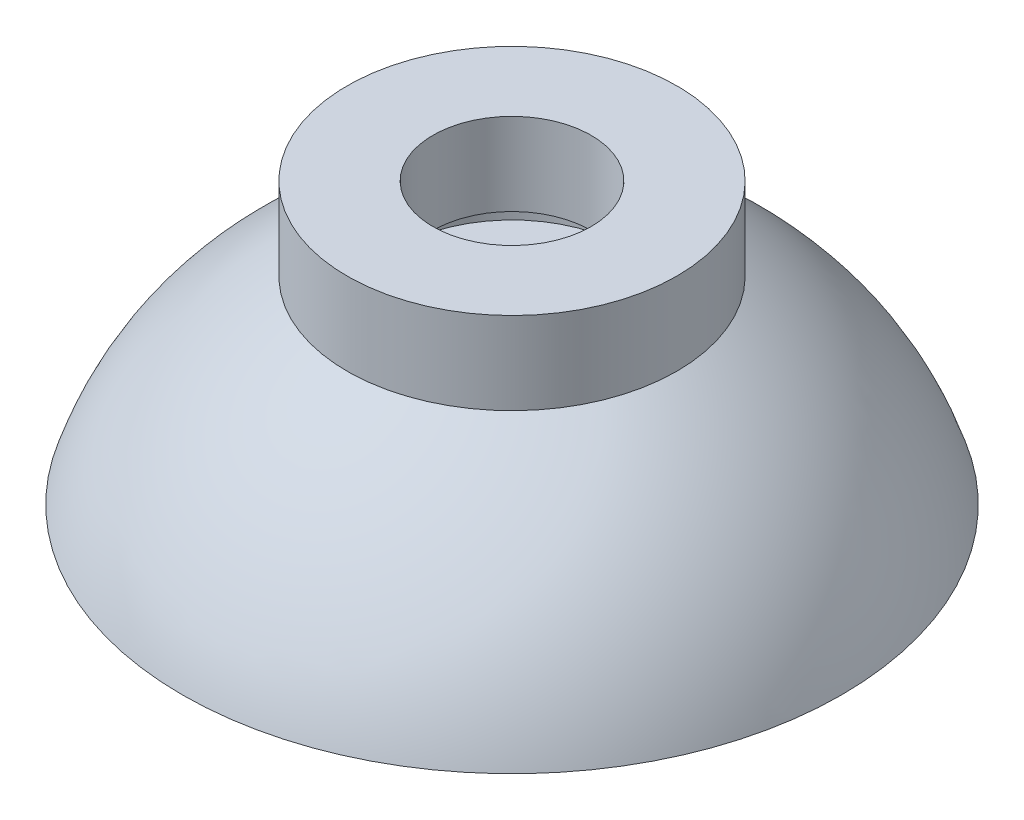
ISO-10303-21;
HEADER;
FILE_DESCRIPTION(('STEP AP214'),'2;1');
FILE_NAME('part.step','',(''),(''),'','','');
FILE_SCHEMA(('AUTOMOTIVE_DESIGN { 1 0 10303 214 1 1 1 1 }'));
ENDSEC;
DATA;
#1=APPLICATION_CONTEXT('core data for automotive mechanical design processes');
#2=APPLICATION_PROTOCOL_DEFINITION('international standard','automotive_design',2000,#1);
#3=PRODUCT_CONTEXT('',#1,'mechanical');
#4=PRODUCT('Part','Part','',(#3));
#5=PRODUCT_RELATED_PRODUCT_CATEGORY('part','',(#4));
#6=PRODUCT_DEFINITION_FORMATION('','',#4);
#7=PRODUCT_DEFINITION_CONTEXT('part definition',#1,'design');
#8=PRODUCT_DEFINITION('design','',#6,#7);
#9=PRODUCT_DEFINITION_SHAPE('','',#8);
#10=(LENGTH_UNIT() NAMED_UNIT(*) SI_UNIT(.MILLI.,.METRE.));
#11=(NAMED_UNIT(*) PLANE_ANGLE_UNIT() SI_UNIT($,.RADIAN.));
#12=(NAMED_UNIT(*) SI_UNIT($,.STERADIAN.) SOLID_ANGLE_UNIT());
#13=UNCERTAINTY_MEASURE_WITH_UNIT(LENGTH_MEASURE(1.E-05),#10,'distance_accuracy_value','');
#14=(GEOMETRIC_REPRESENTATION_CONTEXT(3) GLOBAL_UNCERTAINTY_ASSIGNED_CONTEXT((#13)) GLOBAL_UNIT_ASSIGNED_CONTEXT((#10,
#11,#12)) REPRESENTATION_CONTEXT('',''));
#15=CARTESIAN_POINT('',(0.,0.,0.));
#16=DIRECTION('',(0.,0.,1.));
#17=DIRECTION('',(1.,0.,0.));
#18=AXIS2_PLACEMENT_3D('',#15,#16,#17);
#19=CARTESIAN_POINT('',(0.,-8.50000000000003,0.));
#20=DIRECTION('',(0.,-1.,0.));
#21=DIRECTION('',(1.,0.,0.));
#22=AXIS2_PLACEMENT_3D('',#19,#20,#21);
#23=PLANE('',#22);
#24=CARTESIAN_POINT('',(0.,-8.49999999999995,0.));
#25=DIRECTION('',(0.,-1.,0.));
#26=DIRECTION('',(1.,0.,0.));
#27=AXIS2_PLACEMENT_3D('',#24,#25,#26);
#28=CIRCLE('',#27,20.);
#29=CARTESIAN_POINT('',(20.,-8.49999999999988,0.));
#30=VERTEX_POINT('',#29);
#31=EDGE_CURVE('E10',#30,#30,#28,.T.);
#32=ORIENTED_EDGE('',*,*,#31,.T.);
#33=EDGE_LOOP('',(#32));
#34=FACE_BOUND('',#33,.T.);
#35=ADVANCED_FACE('F32',(#34),#23,.T.);
#36=CARTESIAN_POINT('',(20.,-8.5,0.));
#37=CARTESIAN_POINT('',(17.6708471466282,-1.00335578796486,0.));
#38=CARTESIAN_POINT('',(10.,3.5,0.));
#39=B_SPLINE_CURVE_WITH_KNOTS('',2,(#36,#37,#38),.UNSPECIFIED.,.F.,.F.,(3,3),(0.,1.),.UNSPECIFIED.);
#40=CARTESIAN_POINT('',(3.49524487505443E-12,-1018.94785952558,0.));
#41=DIRECTION('',(0.,-1.,0.));
#42=AXIS1_PLACEMENT('',#40,#41);
#43=SURFACE_OF_REVOLUTION('',#39,#42);
#44=CARTESIAN_POINT('',(0.,3.50000000000006,0.));
#45=DIRECTION('',(0.,-1.,0.));
#46=DIRECTION('',(1.,0.,0.));
#47=AXIS2_PLACEMENT_3D('',#44,#45,#46);
#48=CIRCLE('',#47,10.);
#49=CARTESIAN_POINT('',(10.,3.50000000000009,0.));
#50=VERTEX_POINT('',#49);
#51=EDGE_CURVE('E38',#50,#50,#48,.T.);
#52=ORIENTED_EDGE('',*,*,#51,.T.);
#53=EDGE_LOOP('',(#52));
#54=FACE_BOUND('',#53,.T.);
#55=ORIENTED_EDGE('',*,*,#31,.F.);
#56=EDGE_LOOP('',(#55));
#57=FACE_BOUND('',#56,.T.);
#58=ADVANCED_FACE('F66',(#54,#57),#43,.F.);
#59=CARTESIAN_POINT('',(3.49524487505443E-12,-1018.94785952558,0.));
#60=DIRECTION('',(0.,-1.,0.));
#61=DIRECTION('',(1.,0.,0.));
#62=AXIS2_PLACEMENT_3D('',#59,#60,#61);
#63=CYLINDRICAL_SURFACE('',#62,10.);
#64=CARTESIAN_POINT('',(0.,8.49999999999995,0.));
#65=DIRECTION('',(0.,-1.,0.));
#66=DIRECTION('',(1.,0.,0.));
#67=AXIS2_PLACEMENT_3D('',#64,#65,#66);
#68=CIRCLE('',#67,10.);
#69=CARTESIAN_POINT('',(10.,8.49999999999999,0.));
#70=VERTEX_POINT('',#69);
#71=EDGE_CURVE('E42',#70,#70,#68,.T.);
#72=ORIENTED_EDGE('',*,*,#71,.T.);
#73=EDGE_LOOP('',(#72));
#74=FACE_BOUND('',#73,.T.);
#75=ORIENTED_EDGE('',*,*,#51,.F.);
#76=EDGE_LOOP('',(#75));
#77=FACE_BOUND('',#76,.T.);
#78=ADVANCED_FACE('F69',(#74,#77),#63,.T.);
#79=CARTESIAN_POINT('',(4.8,8.49999999999999,0.));
#80=DIRECTION('',(0.,1.,0.));
#81=DIRECTION('',(-1.,0.,0.));
#82=AXIS2_PLACEMENT_3D('',#79,#80,#81);
#83=PLANE('',#82);
#84=CARTESIAN_POINT('',(0.,8.49999999999995,0.));
#85=DIRECTION('',(0.,-1.,0.));
#86=DIRECTION('',(1.,0.,0.));
#87=AXIS2_PLACEMENT_3D('',#84,#85,#86);
#88=CIRCLE('',#87,4.80000000000002);
#89=CARTESIAN_POINT('',(4.8,8.49999999999997,0.));
#90=VERTEX_POINT('',#89);
#91=EDGE_CURVE('E46',#90,#90,#88,.T.);
#92=ORIENTED_EDGE('',*,*,#91,.T.);
#93=EDGE_LOOP('',(#92));
#94=FACE_BOUND('',#93,.T.);
#95=ORIENTED_EDGE('',*,*,#71,.F.);
#96=EDGE_LOOP('',(#95));
#97=FACE_BOUND('',#96,.T.);
#98=ADVANCED_FACE('F72',(#94,#97),#83,.T.);
#99=CARTESIAN_POINT('',(3.49524487505443E-12,-1018.94785952558,0.));
#100=DIRECTION('',(0.,-1.,0.));
#101=DIRECTION('',(1.,0.,0.));
#102=AXIS2_PLACEMENT_3D('',#99,#100,#101);
#103=CYLINDRICAL_SURFACE('',#102,4.80000000000002);
#104=CARTESIAN_POINT('',(0.,3.50000000000006,0.));
#105=DIRECTION('',(0.,-1.,0.));
#106=DIRECTION('',(1.,0.,0.));
#107=AXIS2_PLACEMENT_3D('',#104,#105,#106);
#108=CIRCLE('',#107,4.80000000000001);
#109=CARTESIAN_POINT('',(4.8,3.50000000000008,0.));
#110=VERTEX_POINT('',#109);
#111=EDGE_CURVE('E51',#110,#110,#108,.T.);
#112=ORIENTED_EDGE('',*,*,#111,.T.);
#113=EDGE_LOOP('',(#112));
#114=FACE_BOUND('',#113,.T.);
#115=ORIENTED_EDGE('',*,*,#91,.F.);
#116=EDGE_LOOP('',(#115));
#117=FACE_BOUND('',#116,.T.);
#118=ADVANCED_FACE('F76',(#114,#117),#103,.F.);
#119=CARTESIAN_POINT('',(4.8,3.5,0.));
#120=DIRECTION('',(0.,-1.,0.));
#121=DIRECTION('',(1.,0.,0.));
#122=AXIS2_PLACEMENT_3D('',#119,#120,#121);
#123=PLANE('',#122);
#124=CARTESIAN_POINT('',(0.,3.50000000000006,0.));
#125=DIRECTION('',(0.,-1.,0.));
#126=DIRECTION('',(1.,0.,0.));
#127=AXIS2_PLACEMENT_3D('',#124,#125,#126);
#128=CIRCLE('',#127,7.00000000000001);
#129=CARTESIAN_POINT('',(7.,3.50000000000008,0.));
#130=VERTEX_POINT('',#129);
#131=EDGE_CURVE('E54',#130,#130,#128,.T.);
#132=ORIENTED_EDGE('',*,*,#131,.T.);
#133=EDGE_LOOP('',(#132));
#134=FACE_BOUND('',#133,.T.);
#135=ORIENTED_EDGE('',*,*,#111,.F.);
#136=EDGE_LOOP('',(#135));
#137=FACE_BOUND('',#136,.T.);
#138=ADVANCED_FACE('F80',(#134,#137),#123,.T.);
#139=CARTESIAN_POINT('',(3.49524487505443E-12,-1018.94785952558,0.));
#140=DIRECTION('',(0.,-1.,0.));
#141=DIRECTION('',(1.,0.,0.));
#142=AXIS2_PLACEMENT_3D('',#139,#140,#141);
#143=CYLINDRICAL_SURFACE('',#142,7.);
#144=CARTESIAN_POINT('',(0.,1.50000000000006,0.));
#145=DIRECTION('',(0.,-1.,0.));
#146=DIRECTION('',(1.,0.,0.));
#147=AXIS2_PLACEMENT_3D('',#144,#145,#146);
#148=CIRCLE('',#147,7.);
#149=CARTESIAN_POINT('',(7.,1.50000000000008,0.));
#150=VERTEX_POINT('',#149);
#151=EDGE_CURVE('E57',#150,#150,#148,.T.);
#152=ORIENTED_EDGE('',*,*,#151,.T.);
#153=EDGE_LOOP('',(#152));
#154=FACE_BOUND('',#153,.T.);
#155=ORIENTED_EDGE('',*,*,#131,.F.);
#156=EDGE_LOOP('',(#155));
#157=FACE_BOUND('',#156,.T.);
#158=ADVANCED_FACE('F84',(#154,#157),#143,.F.);
#159=CARTESIAN_POINT('',(7.,1.50000000000001,0.));
#160=DIRECTION('',(0.,1.,0.));
#161=DIRECTION('',(-1.,0.,0.));
#162=AXIS2_PLACEMENT_3D('',#159,#160,#161);
#163=PLANE('',#162);
#164=ORIENTED_EDGE('',*,*,#151,.F.);
#165=EDGE_LOOP('',(#164));
#166=FACE_BOUND('',#165,.T.);
#167=ADVANCED_FACE('F88',(#166),#163,.T.);
#168=CLOSED_SHELL('',(#35,#58,#78,#98,#118,#138,#158,#167));
#169=MANIFOLD_SOLID_BREP('B2',#168);
#170=ADVANCED_BREP_SHAPE_REPRESENTATION('',(#18,#169),#14);
#171=SHAPE_DEFINITION_REPRESENTATION(#9,#170);
ENDSEC;
END-ISO-10303-21;
